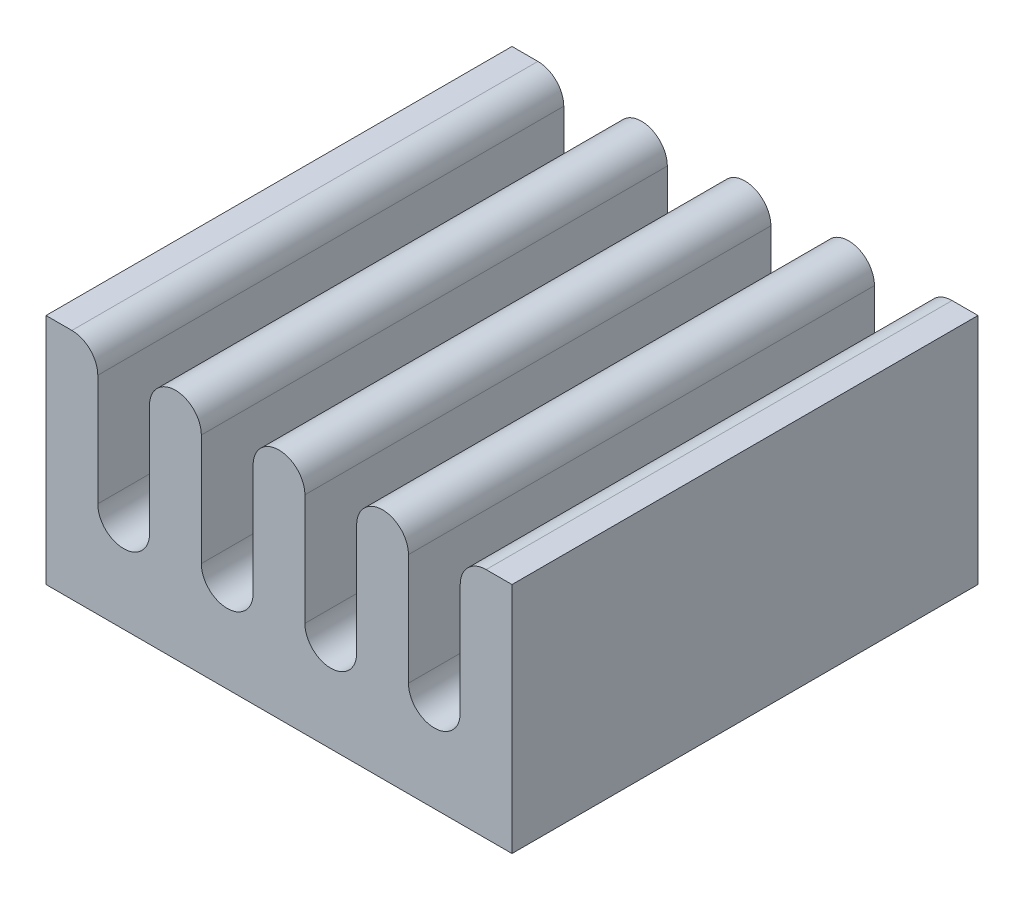
ISO-10303-21;
HEADER;
FILE_DESCRIPTION(('STEP AP214'),'2;1');
FILE_NAME('part.step','',(''),(''),'','','');
FILE_SCHEMA(('AUTOMOTIVE_DESIGN { 1 0 10303 214 1 1 1 1 }'));
ENDSEC;
DATA;
#1=APPLICATION_CONTEXT('core data for automotive mechanical design processes');
#2=APPLICATION_PROTOCOL_DEFINITION('international standard','automotive_design',2000,#1);
#3=PRODUCT_CONTEXT('',#1,'mechanical');
#4=PRODUCT('Part','Part','',(#3));
#5=PRODUCT_RELATED_PRODUCT_CATEGORY('part','',(#4));
#6=PRODUCT_DEFINITION_FORMATION('','',#4);
#7=PRODUCT_DEFINITION_CONTEXT('part definition',#1,'design');
#8=PRODUCT_DEFINITION('design','',#6,#7);
#9=PRODUCT_DEFINITION_SHAPE('','',#8);
#10=(LENGTH_UNIT() NAMED_UNIT(*) SI_UNIT(.MILLI.,.METRE.));
#11=(NAMED_UNIT(*) PLANE_ANGLE_UNIT() SI_UNIT($,.RADIAN.));
#12=(NAMED_UNIT(*) SI_UNIT($,.STERADIAN.) SOLID_ANGLE_UNIT());
#13=UNCERTAINTY_MEASURE_WITH_UNIT(LENGTH_MEASURE(1.E-05),#10,'distance_accuracy_value','');
#14=(GEOMETRIC_REPRESENTATION_CONTEXT(3) GLOBAL_UNCERTAINTY_ASSIGNED_CONTEXT((#13)) GLOBAL_UNIT_ASSIGNED_CONTEXT((#10,
#11,#12)) REPRESENTATION_CONTEXT('',''));
#15=CARTESIAN_POINT('',(0.,0.,0.));
#16=DIRECTION('',(0.,0.,1.));
#17=DIRECTION('',(1.,0.,0.));
#18=AXIS2_PLACEMENT_3D('',#15,#16,#17);
#19=CARTESIAN_POINT('',(4.,4.5,-4.5));
#20=DIRECTION('',(0.,0.,1.));
#21=DIRECTION('',(1.,0.,0.));
#22=AXIS2_PLACEMENT_3D('',#19,#20,#21);
#23=CYLINDRICAL_SURFACE('',#22,0.5);
#24=CARTESIAN_POINT('',(4.,4.5,-4.5));
#25=DIRECTION('',(0.,0.,1.));
#26=DIRECTION('',(1.,0.,0.));
#27=AXIS2_PLACEMENT_3D('',#24,#25,#26);
#28=CIRCLE('',#27,0.5);
#29=CARTESIAN_POINT('',(4.,5.,-4.5));
#30=VERTEX_POINT('',#29);
#31=CARTESIAN_POINT('',(3.5,4.5,-4.5));
#32=VERTEX_POINT('',#31);
#33=EDGE_CURVE('E198',#30,#32,#28,.T.);
#34=ORIENTED_EDGE('',*,*,#33,.T.);
#35=DIRECTION('',(0.,0.,-1.));
#36=VECTOR('',#35,1.);
#37=CARTESIAN_POINT('',(3.5,4.5,-4.5));
#38=LINE('',#37,#36);
#39=CARTESIAN_POINT('',(3.5,4.5,4.5));
#40=VERTEX_POINT('',#39);
#41=EDGE_CURVE('E200',#32,#40,#38,.F.);
#42=ORIENTED_EDGE('',*,*,#41,.T.);
#43=CARTESIAN_POINT('',(4.,4.5,4.5));
#44=DIRECTION('',(0.,0.,1.));
#45=DIRECTION('',(1.,0.,0.));
#46=AXIS2_PLACEMENT_3D('',#43,#44,#45);
#47=CIRCLE('',#46,0.5);
#48=CARTESIAN_POINT('',(4.,5.,4.5));
#49=VERTEX_POINT('',#48);
#50=EDGE_CURVE('E20',#40,#49,#47,.F.);
#51=ORIENTED_EDGE('',*,*,#50,.T.);
#52=DIRECTION('',(0.,0.,1.));
#53=VECTOR('',#52,1.);
#54=CARTESIAN_POINT('',(4.,5.,0.));
#55=LINE('',#54,#53);
#56=EDGE_CURVE('E331',#30,#49,#55,.T.);
#57=ORIENTED_EDGE('',*,*,#56,.F.);
#58=EDGE_LOOP('',(#34,#42,#51,#57));
#59=FACE_BOUND('',#58,.T.);
#60=ADVANCED_FACE('F17',(#59),#23,.T.);
#61=CARTESIAN_POINT('',(3.,2.35,-4.5));
#62=DIRECTION('',(0.,0.,-1.));
#63=DIRECTION('',(-1.,0.,0.));
#64=AXIS2_PLACEMENT_3D('',#61,#62,#63);
#65=CYLINDRICAL_SURFACE('',#64,0.5);
#66=CARTESIAN_POINT('',(3.,2.35,4.5));
#67=DIRECTION('',(0.,0.,-1.));
#68=DIRECTION('',(-1.,0.,0.));
#69=AXIS2_PLACEMENT_3D('',#66,#67,#68);
#70=CIRCLE('',#69,0.5);
#71=CARTESIAN_POINT('',(3.5,2.35,4.5));
#72=VERTEX_POINT('',#71);
#73=CARTESIAN_POINT('',(2.5,2.35,4.5));
#74=VERTEX_POINT('',#73);
#75=EDGE_CURVE('E379',#72,#74,#70,.T.);
#76=ORIENTED_EDGE('',*,*,#75,.F.);
#77=DIRECTION('',(0.,0.,-1.));
#78=VECTOR('',#77,1.);
#79=CARTESIAN_POINT('',(3.5,2.35,-4.5));
#80=LINE('',#79,#78);
#81=CARTESIAN_POINT('',(3.5,2.35,-4.5));
#82=VERTEX_POINT('',#81);
#83=EDGE_CURVE('E204',#72,#82,#80,.T.);
#84=ORIENTED_EDGE('',*,*,#83,.T.);
#85=CARTESIAN_POINT('',(3.,2.35,-4.5));
#86=DIRECTION('',(0.,0.,-1.));
#87=DIRECTION('',(-1.,0.,0.));
#88=AXIS2_PLACEMENT_3D('',#85,#86,#87);
#89=CIRCLE('',#88,0.5);
#90=CARTESIAN_POINT('',(2.5,2.35,-4.5));
#91=VERTEX_POINT('',#90);
#92=EDGE_CURVE('E381',#91,#82,#89,.F.);
#93=ORIENTED_EDGE('',*,*,#92,.F.);
#94=DIRECTION('',(0.,0.,1.));
#95=VECTOR('',#94,1.);
#96=CARTESIAN_POINT('',(2.5,2.35,-4.5));
#97=LINE('',#96,#95);
#98=EDGE_CURVE('E303',#91,#74,#97,.T.);
#99=ORIENTED_EDGE('',*,*,#98,.T.);
#100=EDGE_LOOP('',(#76,#84,#93,#99));
#101=FACE_BOUND('',#100,.T.);
#102=ADVANCED_FACE('F389',(#101),#65,.F.);
#103=CARTESIAN_POINT('',(2.,4.5,-4.5));
#104=DIRECTION('',(0.,0.,1.));
#105=DIRECTION('',(1.,0.,0.));
#106=AXIS2_PLACEMENT_3D('',#103,#104,#105);
#107=CYLINDRICAL_SURFACE('',#106,0.5);
#108=CARTESIAN_POINT('',(2.,4.5,-4.5));
#109=DIRECTION('',(0.,0.,1.));
#110=DIRECTION('',(1.,0.,0.));
#111=AXIS2_PLACEMENT_3D('',#108,#109,#110);
#112=CIRCLE('',#111,0.5);
#113=CARTESIAN_POINT('',(2.5,4.5,-4.5));
#114=VERTEX_POINT('',#113);
#115=CARTESIAN_POINT('',(1.5,4.5,-4.5));
#116=VERTEX_POINT('',#115);
#117=EDGE_CURVE('E375',#114,#116,#112,.T.);
#118=ORIENTED_EDGE('',*,*,#117,.T.);
#119=DIRECTION('',(0.,0.,-1.));
#120=VECTOR('',#119,1.);
#121=CARTESIAN_POINT('',(1.5,4.5,-4.5));
#122=LINE('',#121,#120);
#123=CARTESIAN_POINT('',(1.5,4.5,4.5));
#124=VERTEX_POINT('',#123);
#125=EDGE_CURVE('E300',#116,#124,#122,.F.);
#126=ORIENTED_EDGE('',*,*,#125,.T.);
#127=CARTESIAN_POINT('',(2.,4.5,4.5));
#128=DIRECTION('',(0.,0.,1.));
#129=DIRECTION('',(1.,0.,0.));
#130=AXIS2_PLACEMENT_3D('',#127,#128,#129);
#131=CIRCLE('',#130,0.5);
#132=CARTESIAN_POINT('',(2.5,4.5,4.5));
#133=VERTEX_POINT('',#132);
#134=EDGE_CURVE('E377',#124,#133,#131,.F.);
#135=ORIENTED_EDGE('',*,*,#134,.T.);
#136=DIRECTION('',(0.,0.,1.));
#137=VECTOR('',#136,1.);
#138=CARTESIAN_POINT('',(2.5,4.5,-4.5));
#139=LINE('',#138,#137);
#140=EDGE_CURVE('E308',#133,#114,#139,.F.);
#141=ORIENTED_EDGE('',*,*,#140,.T.);
#142=EDGE_LOOP('',(#118,#126,#135,#141));
#143=FACE_BOUND('',#142,.T.);
#144=ADVANCED_FACE('F642',(#143),#107,.T.);
#145=CARTESIAN_POINT('',(1.,2.35,-4.5));
#146=DIRECTION('',(0.,0.,-1.));
#147=DIRECTION('',(-1.,0.,0.));
#148=AXIS2_PLACEMENT_3D('',#145,#146,#147);
#149=CYLINDRICAL_SURFACE('',#148,0.5);
#150=CARTESIAN_POINT('',(1.,2.35,4.5));
#151=DIRECTION('',(0.,0.,-1.));
#152=DIRECTION('',(-1.,0.,0.));
#153=AXIS2_PLACEMENT_3D('',#150,#151,#152);
#154=CIRCLE('',#153,0.5);
#155=CARTESIAN_POINT('',(1.5,2.35,4.5));
#156=VERTEX_POINT('',#155);
#157=CARTESIAN_POINT('',(0.500000000000001,2.35,4.5));
#158=VERTEX_POINT('',#157);
#159=EDGE_CURVE('E371',#156,#158,#154,.T.);
#160=ORIENTED_EDGE('',*,*,#159,.F.);
#161=DIRECTION('',(0.,0.,-1.));
#162=VECTOR('',#161,1.);
#163=CARTESIAN_POINT('',(1.5,2.35,-4.5));
#164=LINE('',#163,#162);
#165=CARTESIAN_POINT('',(1.5,2.35,-4.5));
#166=VERTEX_POINT('',#165);
#167=EDGE_CURVE('E299',#156,#166,#164,.T.);
#168=ORIENTED_EDGE('',*,*,#167,.T.);
#169=CARTESIAN_POINT('',(1.,2.35,-4.5));
#170=DIRECTION('',(0.,0.,-1.));
#171=DIRECTION('',(-1.,0.,0.));
#172=AXIS2_PLACEMENT_3D('',#169,#170,#171);
#173=CIRCLE('',#172,0.5);
#174=CARTESIAN_POINT('',(0.5,2.35,-4.5));
#175=VERTEX_POINT('',#174);
#176=EDGE_CURVE('E373',#175,#166,#173,.F.);
#177=ORIENTED_EDGE('',*,*,#176,.F.);
#178=DIRECTION('',(0.,0.,1.));
#179=VECTOR('',#178,1.);
#180=CARTESIAN_POINT('',(0.5,2.35,-4.5));
#181=LINE('',#180,#179);
#182=EDGE_CURVE('E291',#175,#158,#181,.T.);
#183=ORIENTED_EDGE('',*,*,#182,.T.);
#184=EDGE_LOOP('',(#160,#168,#177,#183));
#185=FACE_BOUND('',#184,.T.);
#186=ADVANCED_FACE('F634',(#185),#149,.F.);
#187=CARTESIAN_POINT('',(0.,4.5,-4.5));
#188=DIRECTION('',(0.,0.,1.));
#189=DIRECTION('',(1.,0.,0.));
#190=AXIS2_PLACEMENT_3D('',#187,#188,#189);
#191=CYLINDRICAL_SURFACE('',#190,0.5);
#192=CARTESIAN_POINT('',(0.,4.5,-4.5));
#193=DIRECTION('',(0.,0.,1.));
#194=DIRECTION('',(1.,0.,0.));
#195=AXIS2_PLACEMENT_3D('',#192,#193,#194);
#196=CIRCLE('',#195,0.5);
#197=CARTESIAN_POINT('',(0.5,4.5,-4.5));
#198=VERTEX_POINT('',#197);
#199=CARTESIAN_POINT('',(-0.5,4.5,-4.5));
#200=VERTEX_POINT('',#199);
#201=EDGE_CURVE('E367',#198,#200,#196,.T.);
#202=ORIENTED_EDGE('',*,*,#201,.T.);
#203=DIRECTION('',(0.,0.,-1.));
#204=VECTOR('',#203,1.);
#205=CARTESIAN_POINT('',(-0.5,4.5,-4.5));
#206=LINE('',#205,#204);
#207=CARTESIAN_POINT('',(-0.499999999999999,4.5,4.5));
#208=VERTEX_POINT('',#207);
#209=EDGE_CURVE('E288',#200,#208,#206,.F.);
#210=ORIENTED_EDGE('',*,*,#209,.T.);
#211=CARTESIAN_POINT('',(0.,4.5,4.5));
#212=DIRECTION('',(0.,0.,1.));
#213=DIRECTION('',(1.,0.,0.));
#214=AXIS2_PLACEMENT_3D('',#211,#212,#213);
#215=CIRCLE('',#214,0.5);
#216=CARTESIAN_POINT('',(0.500000000000001,4.5,4.5));
#217=VERTEX_POINT('',#216);
#218=EDGE_CURVE('E369',#208,#217,#215,.F.);
#219=ORIENTED_EDGE('',*,*,#218,.T.);
#220=DIRECTION('',(0.,0.,1.));
#221=VECTOR('',#220,1.);
#222=CARTESIAN_POINT('',(0.5,4.5,-4.5));
#223=LINE('',#222,#221);
#224=EDGE_CURVE('E296',#217,#198,#223,.F.);
#225=ORIENTED_EDGE('',*,*,#224,.T.);
#226=EDGE_LOOP('',(#202,#210,#219,#225));
#227=FACE_BOUND('',#226,.T.);
#228=ADVANCED_FACE('F626',(#227),#191,.T.);
#229=CARTESIAN_POINT('',(-1.,2.35,-4.5));
#230=DIRECTION('',(0.,0.,-1.));
#231=DIRECTION('',(-1.,0.,0.));
#232=AXIS2_PLACEMENT_3D('',#229,#230,#231);
#233=CYLINDRICAL_SURFACE('',#232,0.5);
#234=CARTESIAN_POINT('',(-0.999999999999999,2.35,4.5));
#235=DIRECTION('',(0.,0.,-1.));
#236=DIRECTION('',(-1.,0.,0.));
#237=AXIS2_PLACEMENT_3D('',#234,#235,#236);
#238=CIRCLE('',#237,0.5);
#239=CARTESIAN_POINT('',(-0.499999999999999,2.35,4.5));
#240=VERTEX_POINT('',#239);
#241=CARTESIAN_POINT('',(-1.5,2.35,4.5));
#242=VERTEX_POINT('',#241);
#243=EDGE_CURVE('E363',#240,#242,#238,.T.);
#244=ORIENTED_EDGE('',*,*,#243,.F.);
#245=DIRECTION('',(0.,0.,-1.));
#246=VECTOR('',#245,1.);
#247=CARTESIAN_POINT('',(-0.5,2.35,-4.5));
#248=LINE('',#247,#246);
#249=CARTESIAN_POINT('',(-0.5,2.35,-4.5));
#250=VERTEX_POINT('',#249);
#251=EDGE_CURVE('E287',#240,#250,#248,.T.);
#252=ORIENTED_EDGE('',*,*,#251,.T.);
#253=CARTESIAN_POINT('',(-1.,2.35,-4.5));
#254=DIRECTION('',(0.,0.,-1.));
#255=DIRECTION('',(-1.,0.,0.));
#256=AXIS2_PLACEMENT_3D('',#253,#254,#255);
#257=CIRCLE('',#256,0.5);
#258=CARTESIAN_POINT('',(-1.5,2.35,-4.5));
#259=VERTEX_POINT('',#258);
#260=EDGE_CURVE('E365',#259,#250,#257,.F.);
#261=ORIENTED_EDGE('',*,*,#260,.F.);
#262=DIRECTION('',(0.,0.,1.));
#263=VECTOR('',#262,1.);
#264=CARTESIAN_POINT('',(-1.5,2.35,-4.5));
#265=LINE('',#264,#263);
#266=EDGE_CURVE('E279',#259,#242,#265,.T.);
#267=ORIENTED_EDGE('',*,*,#266,.T.);
#268=EDGE_LOOP('',(#244,#252,#261,#267));
#269=FACE_BOUND('',#268,.T.);
#270=ADVANCED_FACE('F618',(#269),#233,.F.);
#271=CARTESIAN_POINT('',(-2.,4.5,-4.5));
#272=DIRECTION('',(0.,0.,1.));
#273=DIRECTION('',(1.,0.,0.));
#274=AXIS2_PLACEMENT_3D('',#271,#272,#273);
#275=CYLINDRICAL_SURFACE('',#274,0.5);
#276=CARTESIAN_POINT('',(-2.,4.5,-4.5));
#277=DIRECTION('',(0.,0.,1.));
#278=DIRECTION('',(1.,0.,0.));
#279=AXIS2_PLACEMENT_3D('',#276,#277,#278);
#280=CIRCLE('',#279,0.5);
#281=CARTESIAN_POINT('',(-1.5,4.5,-4.5));
#282=VERTEX_POINT('',#281);
#283=CARTESIAN_POINT('',(-2.5,4.5,-4.5));
#284=VERTEX_POINT('',#283);
#285=EDGE_CURVE('E359',#282,#284,#280,.T.);
#286=ORIENTED_EDGE('',*,*,#285,.T.);
#287=DIRECTION('',(0.,0.,-1.));
#288=VECTOR('',#287,1.);
#289=CARTESIAN_POINT('',(-2.5,4.5,-4.5));
#290=LINE('',#289,#288);
#291=CARTESIAN_POINT('',(-2.5,4.5,4.5));
#292=VERTEX_POINT('',#291);
#293=EDGE_CURVE('E276',#284,#292,#290,.F.);
#294=ORIENTED_EDGE('',*,*,#293,.T.);
#295=CARTESIAN_POINT('',(-2.,4.5,4.5));
#296=DIRECTION('',(0.,0.,1.));
#297=DIRECTION('',(1.,0.,0.));
#298=AXIS2_PLACEMENT_3D('',#295,#296,#297);
#299=CIRCLE('',#298,0.5);
#300=CARTESIAN_POINT('',(-1.5,4.5,4.5));
#301=VERTEX_POINT('',#300);
#302=EDGE_CURVE('E361',#292,#301,#299,.F.);
#303=ORIENTED_EDGE('',*,*,#302,.T.);
#304=DIRECTION('',(0.,0.,1.));
#305=VECTOR('',#304,1.);
#306=CARTESIAN_POINT('',(-1.5,4.5,-4.5));
#307=LINE('',#306,#305);
#308=EDGE_CURVE('E284',#301,#282,#307,.F.);
#309=ORIENTED_EDGE('',*,*,#308,.T.);
#310=EDGE_LOOP('',(#286,#294,#303,#309));
#311=FACE_BOUND('',#310,.T.);
#312=ADVANCED_FACE('F610',(#311),#275,.T.);
#313=CARTESIAN_POINT('',(-4.,4.5,-4.5));
#314=DIRECTION('',(0.,0.,-1.));
#315=DIRECTION('',(-1.,0.,0.));
#316=AXIS2_PLACEMENT_3D('',#313,#314,#315);
#317=CYLINDRICAL_SURFACE('',#316,0.5);
#318=CARTESIAN_POINT('',(-4.,4.5,4.5));
#319=DIRECTION('',(0.,0.,-1.));
#320=DIRECTION('',(-1.,0.,0.));
#321=AXIS2_PLACEMENT_3D('',#318,#319,#320);
#322=CIRCLE('',#321,0.5);
#323=CARTESIAN_POINT('',(-4.,5.,4.5));
#324=VERTEX_POINT('',#323);
#325=CARTESIAN_POINT('',(-3.5,4.5,4.5));
#326=VERTEX_POINT('',#325);
#327=EDGE_CURVE('E355',#324,#326,#322,.T.);
#328=ORIENTED_EDGE('',*,*,#327,.T.);
#329=DIRECTION('',(0.,0.,1.));
#330=VECTOR('',#329,1.);
#331=CARTESIAN_POINT('',(-3.5,4.5,-4.5));
#332=LINE('',#331,#330);
#333=CARTESIAN_POINT('',(-3.5,4.5,-4.5));
#334=VERTEX_POINT('',#333);
#335=EDGE_CURVE('E272',#326,#334,#332,.F.);
#336=ORIENTED_EDGE('',*,*,#335,.T.);
#337=CARTESIAN_POINT('',(-4.,4.5,-4.5));
#338=DIRECTION('',(0.,0.,-1.));
#339=DIRECTION('',(-1.,0.,0.));
#340=AXIS2_PLACEMENT_3D('',#337,#338,#339);
#341=CIRCLE('',#340,0.5);
#342=CARTESIAN_POINT('',(-4.,5.,-4.5));
#343=VERTEX_POINT('',#342);
#344=EDGE_CURVE('E357',#334,#343,#341,.F.);
#345=ORIENTED_EDGE('',*,*,#344,.T.);
#346=DIRECTION('',(0.,0.,1.));
#347=VECTOR('',#346,1.);
#348=CARTESIAN_POINT('',(-4.,5.,0.));
#349=LINE('',#348,#347);
#350=EDGE_CURVE('E312',#324,#343,#349,.F.);
#351=ORIENTED_EDGE('',*,*,#350,.F.);
#352=EDGE_LOOP('',(#328,#336,#345,#351));
#353=FACE_BOUND('',#352,.T.);
#354=ADVANCED_FACE('F602',(#353),#317,.T.);
#355=CARTESIAN_POINT('',(-3.,2.35,-4.5));
#356=DIRECTION('',(0.,0.,-1.));
#357=DIRECTION('',(-1.,0.,0.));
#358=AXIS2_PLACEMENT_3D('',#355,#356,#357);
#359=CYLINDRICAL_SURFACE('',#358,0.5);
#360=CARTESIAN_POINT('',(-3.,2.35,4.5));
#361=DIRECTION('',(0.,0.,-1.));
#362=DIRECTION('',(-1.,0.,0.));
#363=AXIS2_PLACEMENT_3D('',#360,#361,#362);
#364=CIRCLE('',#363,0.5);
#365=CARTESIAN_POINT('',(-2.5,2.35,4.5));
#366=VERTEX_POINT('',#365);
#367=CARTESIAN_POINT('',(-3.5,2.35,4.5));
#368=VERTEX_POINT('',#367);
#369=EDGE_CURVE('E345',#366,#368,#364,.T.);
#370=ORIENTED_EDGE('',*,*,#369,.F.);
#371=DIRECTION('',(0.,0.,-1.));
#372=VECTOR('',#371,1.);
#373=CARTESIAN_POINT('',(-2.5,2.35,-4.5));
#374=LINE('',#373,#372);
#375=CARTESIAN_POINT('',(-2.5,2.35,-4.5));
#376=VERTEX_POINT('',#375);
#377=EDGE_CURVE('E275',#366,#376,#374,.T.);
#378=ORIENTED_EDGE('',*,*,#377,.T.);
#379=CARTESIAN_POINT('',(-3.,2.35,-4.5));
#380=DIRECTION('',(0.,0.,-1.));
#381=DIRECTION('',(-1.,0.,0.));
#382=AXIS2_PLACEMENT_3D('',#379,#380,#381);
#383=CIRCLE('',#382,0.5);
#384=CARTESIAN_POINT('',(-3.5,2.35,-4.5));
#385=VERTEX_POINT('',#384);
#386=EDGE_CURVE('E353',#385,#376,#383,.F.);
#387=ORIENTED_EDGE('',*,*,#386,.F.);
#388=DIRECTION('',(0.,0.,1.));
#389=VECTOR('',#388,1.);
#390=CARTESIAN_POINT('',(-3.5,2.35,-4.5));
#391=LINE('',#390,#389);
#392=EDGE_CURVE('E269',#385,#368,#391,.T.);
#393=ORIENTED_EDGE('',*,*,#392,.T.);
#394=EDGE_LOOP('',(#370,#378,#387,#393));
#395=FACE_BOUND('',#394,.T.);
#396=ADVANCED_FACE('F456',(#395),#359,.F.);
#397=CARTESIAN_POINT('',(0.,0.,0.));
#398=DIRECTION('',(0.,1.,0.));
#399=DIRECTION('',(0.,0.,1.));
#400=AXIS2_PLACEMENT_3D('',#397,#398,#399);
#401=PLANE('',#400);
#402=DIRECTION('',(-1.,0.,0.));
#403=VECTOR('',#402,1.);
#404=CARTESIAN_POINT('',(-3.5,0.,-4.));
#405=LINE('',#404,#403);
#406=CARTESIAN_POINT('',(2.5,0.,-4.));
#407=VERTEX_POINT('',#406);
#408=CARTESIAN_POINT('',(-3.5,0.,-4.));
#409=VERTEX_POINT('',#408);
#410=EDGE_CURVE('E257',#407,#409,#405,.T.);
#411=ORIENTED_EDGE('',*,*,#410,.F.);
#412=DIRECTION('',(0.,0.,-1.));
#413=VECTOR('',#412,1.);
#414=CARTESIAN_POINT('',(2.5,0.,2.));
#415=LINE('',#414,#413);
#416=CARTESIAN_POINT('',(2.5,0.,2.));
#417=VERTEX_POINT('',#416);
#418=EDGE_CURVE('E263',#417,#407,#415,.T.);
#419=ORIENTED_EDGE('',*,*,#418,.F.);
#420=DIRECTION('',(1.,0.,0.));
#421=VECTOR('',#420,1.);
#422=CARTESIAN_POINT('',(-3.5,0.,2.));
#423=LINE('',#422,#421);
#424=CARTESIAN_POINT('',(-3.5,0.,2.));
#425=VERTEX_POINT('',#424);
#426=EDGE_CURVE('E266',#425,#417,#423,.T.);
#427=ORIENTED_EDGE('',*,*,#426,.F.);
#428=DIRECTION('',(0.,0.,1.));
#429=VECTOR('',#428,1.);
#430=CARTESIAN_POINT('',(-3.5,0.,2.));
#431=LINE('',#430,#429);
#432=EDGE_CURVE('E251',#409,#425,#431,.T.);
#433=ORIENTED_EDGE('',*,*,#432,.F.);
#434=EDGE_LOOP('',(#411,#419,#427,#433));
#435=FACE_BOUND('',#434,.T.);
#436=ADVANCED_FACE('F448',(#435),#401,.F.);
#437=CARTESIAN_POINT('',(0.,5.,0.));
#438=DIRECTION('',(0.,1.,0.));
#439=DIRECTION('',(0.,0.,1.));
#440=AXIS2_PLACEMENT_3D('',#437,#438,#439);
#441=PLANE('',#440);
#442=DIRECTION('',(1.,0.,0.));
#443=VECTOR('',#442,1.);
#444=CARTESIAN_POINT('',(0.,5.,4.5));
#445=LINE('',#444,#443);
#446=CARTESIAN_POINT('',(4.5,5.,4.5));
#447=VERTEX_POINT('',#446);
#448=EDGE_CURVE('E194',#49,#447,#445,.T.);
#449=ORIENTED_EDGE('',*,*,#448,.T.);
#450=DIRECTION('',(0.,0.,1.));
#451=VECTOR('',#450,1.);
#452=CARTESIAN_POINT('',(4.5,5.,-4.5));
#453=LINE('',#452,#451);
#454=CARTESIAN_POINT('',(4.5,5.,-4.5));
#455=VERTEX_POINT('',#454);
#456=EDGE_CURVE('E242',#447,#455,#453,.F.);
#457=ORIENTED_EDGE('',*,*,#456,.T.);
#458=DIRECTION('',(1.,0.,0.));
#459=VECTOR('',#458,1.);
#460=CARTESIAN_POINT('',(0.,5.,-4.5));
#461=LINE('',#460,#459);
#462=EDGE_CURVE('E333',#455,#30,#461,.F.);
#463=ORIENTED_EDGE('',*,*,#462,.T.);
#464=ORIENTED_EDGE('',*,*,#56,.T.);
#465=EDGE_LOOP('',(#449,#457,#463,#464));
#466=FACE_BOUND('',#465,.T.);
#467=ADVANCED_FACE('F446',(#466),#441,.T.);
#468=CARTESIAN_POINT('',(0.,5.,0.));
#469=DIRECTION('',(0.,1.,0.));
#470=DIRECTION('',(0.,0.,1.));
#471=AXIS2_PLACEMENT_3D('',#468,#469,#470);
#472=PLANE('',#471);
#473=DIRECTION('',(1.,0.,0.));
#474=VECTOR('',#473,1.);
#475=CARTESIAN_POINT('',(0.,5.,-4.5));
#476=LINE('',#475,#474);
#477=CARTESIAN_POINT('',(-4.5,5.,-4.5));
#478=VERTEX_POINT('',#477);
#479=EDGE_CURVE('E205',#343,#478,#476,.F.);
#480=ORIENTED_EDGE('',*,*,#479,.T.);
#481=DIRECTION('',(0.,0.,-1.));
#482=VECTOR('',#481,1.);
#483=CARTESIAN_POINT('',(-4.5,5.,-4.5));
#484=LINE('',#483,#482);
#485=CARTESIAN_POINT('',(-4.5,5.,4.5));
#486=VERTEX_POINT('',#485);
#487=EDGE_CURVE('E213',#478,#486,#484,.F.);
#488=ORIENTED_EDGE('',*,*,#487,.T.);
#489=DIRECTION('',(-1.,0.,0.));
#490=VECTOR('',#489,1.);
#491=CARTESIAN_POINT('',(-4.5,5.,4.5));
#492=LINE('',#491,#490);
#493=EDGE_CURVE('E239',#486,#324,#492,.F.);
#494=ORIENTED_EDGE('',*,*,#493,.T.);
#495=ORIENTED_EDGE('',*,*,#350,.T.);
#496=EDGE_LOOP('',(#480,#488,#494,#495));
#497=FACE_BOUND('',#496,.T.);
#498=ADVANCED_FACE('F438',(#497),#472,.T.);
#499=CARTESIAN_POINT('',(3.5,-9.05538513813741,-4.5));
#500=DIRECTION('',(1.,0.,0.));
#501=DIRECTION('',(0.,0.,-1.));
#502=AXIS2_PLACEMENT_3D('',#499,#500,#501);
#503=PLANE('',#502);
#504=ORIENTED_EDGE('',*,*,#83,.F.);
#505=DIRECTION('',(0.,1.,0.));
#506=VECTOR('',#505,1.);
#507=CARTESIAN_POINT('',(3.5,5.,4.5));
#508=LINE('',#507,#506);
#509=EDGE_CURVE('E193',#72,#40,#508,.T.);
#510=ORIENTED_EDGE('',*,*,#509,.T.);
#511=ORIENTED_EDGE('',*,*,#41,.F.);
#512=DIRECTION('',(0.,1.,0.));
#513=VECTOR('',#512,1.);
#514=CARTESIAN_POINT('',(3.5,5.,-4.5));
#515=LINE('',#514,#513);
#516=EDGE_CURVE('E219',#32,#82,#515,.F.);
#517=ORIENTED_EDGE('',*,*,#516,.T.);
#518=EDGE_LOOP('',(#504,#510,#511,#517));
#519=FACE_BOUND('',#518,.T.);
#520=ADVANCED_FACE('F208',(#519),#503,.F.);
#521=CARTESIAN_POINT('',(2.5,-9.05538513813741,-4.5));
#522=DIRECTION('',(-1.,0.,0.));
#523=DIRECTION('',(0.,0.,1.));
#524=AXIS2_PLACEMENT_3D('',#521,#522,#523);
#525=PLANE('',#524);
#526=ORIENTED_EDGE('',*,*,#98,.F.);
#527=DIRECTION('',(0.,1.,0.));
#528=VECTOR('',#527,1.);
#529=CARTESIAN_POINT('',(2.5,5.,-4.5));
#530=LINE('',#529,#528);
#531=EDGE_CURVE('E386',#91,#114,#530,.T.);
#532=ORIENTED_EDGE('',*,*,#531,.T.);
#533=ORIENTED_EDGE('',*,*,#140,.F.);
#534=DIRECTION('',(0.,1.,0.));
#535=VECTOR('',#534,1.);
#536=CARTESIAN_POINT('',(2.5,5.,4.5));
#537=LINE('',#536,#535);
#538=EDGE_CURVE('E211',#133,#74,#537,.F.);
#539=ORIENTED_EDGE('',*,*,#538,.T.);
#540=EDGE_LOOP('',(#526,#532,#533,#539));
#541=FACE_BOUND('',#540,.T.);
#542=ADVANCED_FACE('F511',(#541),#525,.F.);
#543=CARTESIAN_POINT('',(1.5,-9.05538513813741,-4.5));
#544=DIRECTION('',(1.,0.,0.));
#545=DIRECTION('',(0.,0.,-1.));
#546=AXIS2_PLACEMENT_3D('',#543,#544,#545);
#547=PLANE('',#546);
#548=ORIENTED_EDGE('',*,*,#167,.F.);
#549=DIRECTION('',(0.,1.,0.));
#550=VECTOR('',#549,1.);
#551=CARTESIAN_POINT('',(1.5,5.,4.5));
#552=LINE('',#551,#550);
#553=EDGE_CURVE('E216',#156,#124,#552,.T.);
#554=ORIENTED_EDGE('',*,*,#553,.T.);
#555=ORIENTED_EDGE('',*,*,#125,.F.);
#556=DIRECTION('',(0.,1.,0.));
#557=VECTOR('',#556,1.);
#558=CARTESIAN_POINT('',(1.5,5.,-4.5));
#559=LINE('',#558,#557);
#560=EDGE_CURVE('E390',#116,#166,#559,.F.);
#561=ORIENTED_EDGE('',*,*,#560,.T.);
#562=EDGE_LOOP('',(#548,#554,#555,#561));
#563=FACE_BOUND('',#562,.T.);
#564=ADVANCED_FACE('F507',(#563),#547,.F.);
#565=CARTESIAN_POINT('',(0.5,-9.05538513813741,-4.5));
#566=DIRECTION('',(-1.,0.,0.));
#567=DIRECTION('',(0.,0.,1.));
#568=AXIS2_PLACEMENT_3D('',#565,#566,#567);
#569=PLANE('',#568);
#570=ORIENTED_EDGE('',*,*,#182,.F.);
#571=DIRECTION('',(0.,1.,0.));
#572=VECTOR('',#571,1.);
#573=CARTESIAN_POINT('',(0.5,5.,-4.5));
#574=LINE('',#573,#572);
#575=EDGE_CURVE('E394',#175,#198,#574,.T.);
#576=ORIENTED_EDGE('',*,*,#575,.T.);
#577=ORIENTED_EDGE('',*,*,#224,.F.);
#578=DIRECTION('',(0.,1.,0.));
#579=VECTOR('',#578,1.);
#580=CARTESIAN_POINT('',(0.500000000000001,5.,4.5));
#581=LINE('',#580,#579);
#582=EDGE_CURVE('E224',#217,#158,#581,.F.);
#583=ORIENTED_EDGE('',*,*,#582,.T.);
#584=EDGE_LOOP('',(#570,#576,#577,#583));
#585=FACE_BOUND('',#584,.T.);
#586=ADVANCED_FACE('F503',(#585),#569,.F.);
#587=CARTESIAN_POINT('',(-0.5,-9.05538513813741,-4.5));
#588=DIRECTION('',(1.,0.,0.));
#589=DIRECTION('',(0.,0.,-1.));
#590=AXIS2_PLACEMENT_3D('',#587,#588,#589);
#591=PLANE('',#590);
#592=ORIENTED_EDGE('',*,*,#251,.F.);
#593=DIRECTION('',(0.,1.,0.));
#594=VECTOR('',#593,1.);
#595=CARTESIAN_POINT('',(-0.5,5.,4.5));
#596=LINE('',#595,#594);
#597=EDGE_CURVE('E227',#240,#208,#596,.T.);
#598=ORIENTED_EDGE('',*,*,#597,.T.);
#599=ORIENTED_EDGE('',*,*,#209,.F.);
#600=DIRECTION('',(0.,1.,0.));
#601=VECTOR('',#600,1.);
#602=CARTESIAN_POINT('',(-0.5,5.,-4.5));
#603=LINE('',#602,#601);
#604=EDGE_CURVE('E399',#200,#250,#603,.F.);
#605=ORIENTED_EDGE('',*,*,#604,.T.);
#606=EDGE_LOOP('',(#592,#598,#599,#605));
#607=FACE_BOUND('',#606,.T.);
#608=ADVANCED_FACE('F499',(#607),#591,.F.);
#609=CARTESIAN_POINT('',(-1.5,-9.05538513813741,-4.5));
#610=DIRECTION('',(-1.,0.,0.));
#611=DIRECTION('',(0.,0.,1.));
#612=AXIS2_PLACEMENT_3D('',#609,#610,#611);
#613=PLANE('',#612);
#614=ORIENTED_EDGE('',*,*,#266,.F.);
#615=DIRECTION('',(0.,1.,0.));
#616=VECTOR('',#615,1.);
#617=CARTESIAN_POINT('',(-1.5,5.,-4.5));
#618=LINE('',#617,#616);
#619=EDGE_CURVE('E402',#259,#282,#618,.T.);
#620=ORIENTED_EDGE('',*,*,#619,.T.);
#621=ORIENTED_EDGE('',*,*,#308,.F.);
#622=DIRECTION('',(0.,1.,0.));
#623=VECTOR('',#622,1.);
#624=CARTESIAN_POINT('',(-1.5,5.,4.5));
#625=LINE('',#624,#623);
#626=EDGE_CURVE('E230',#301,#242,#625,.F.);
#627=ORIENTED_EDGE('',*,*,#626,.T.);
#628=EDGE_LOOP('',(#614,#620,#621,#627));
#629=FACE_BOUND('',#628,.T.);
#630=ADVANCED_FACE('F495',(#629),#613,.F.);
#631=CARTESIAN_POINT('',(-2.5,-9.05538513813741,-4.5));
#632=DIRECTION('',(1.,0.,0.));
#633=DIRECTION('',(0.,0.,-1.));
#634=AXIS2_PLACEMENT_3D('',#631,#632,#633);
#635=PLANE('',#634);
#636=ORIENTED_EDGE('',*,*,#377,.F.);
#637=DIRECTION('',(0.,1.,0.));
#638=VECTOR('',#637,1.);
#639=CARTESIAN_POINT('',(-2.5,5.,4.5));
#640=LINE('',#639,#638);
#641=EDGE_CURVE('E233',#366,#292,#640,.T.);
#642=ORIENTED_EDGE('',*,*,#641,.T.);
#643=ORIENTED_EDGE('',*,*,#293,.F.);
#644=DIRECTION('',(0.,1.,0.));
#645=VECTOR('',#644,1.);
#646=CARTESIAN_POINT('',(-2.5,5.,-4.5));
#647=LINE('',#646,#645);
#648=EDGE_CURVE('E405',#284,#376,#647,.F.);
#649=ORIENTED_EDGE('',*,*,#648,.T.);
#650=EDGE_LOOP('',(#636,#642,#643,#649));
#651=FACE_BOUND('',#650,.T.);
#652=ADVANCED_FACE('F491',(#651),#635,.F.);
#653=CARTESIAN_POINT('',(-3.5,-9.05538513813741,-4.5));
#654=DIRECTION('',(-1.,0.,0.));
#655=DIRECTION('',(0.,0.,1.));
#656=AXIS2_PLACEMENT_3D('',#653,#654,#655);
#657=PLANE('',#656);
#658=ORIENTED_EDGE('',*,*,#392,.F.);
#659=DIRECTION('',(0.,1.,0.));
#660=VECTOR('',#659,1.);
#661=CARTESIAN_POINT('',(-3.5,5.,-4.5));
#662=LINE('',#661,#660);
#663=EDGE_CURVE('E328',#385,#334,#662,.T.);
#664=ORIENTED_EDGE('',*,*,#663,.T.);
#665=ORIENTED_EDGE('',*,*,#335,.F.);
#666=DIRECTION('',(0.,1.,0.));
#667=VECTOR('',#666,1.);
#668=CARTESIAN_POINT('',(-3.5,5.,4.5));
#669=LINE('',#668,#667);
#670=EDGE_CURVE('E236',#326,#368,#669,.F.);
#671=ORIENTED_EDGE('',*,*,#670,.T.);
#672=EDGE_LOOP('',(#658,#664,#665,#671));
#673=FACE_BOUND('',#672,.T.);
#674=ADVANCED_FACE('F487',(#673),#657,.F.);
#675=CARTESIAN_POINT('',(-3.5,0.5,2.));
#676=DIRECTION('',(0.,0.,1.));
#677=DIRECTION('',(1.,0.,0.));
#678=AXIS2_PLACEMENT_3D('',#675,#676,#677);
#679=PLANE('',#678);
#680=DIRECTION('',(1.,0.,0.));
#681=VECTOR('',#680,1.);
#682=CARTESIAN_POINT('',(0.,0.5,2.));
#683=LINE('',#682,#681);
#684=CARTESIAN_POINT('',(-3.5,0.5,2.));
#685=VERTEX_POINT('',#684);
#686=CARTESIAN_POINT('',(2.5,0.5,2.));
#687=VERTEX_POINT('',#686);
#688=EDGE_CURVE('E327',#685,#687,#683,.T.);
#689=ORIENTED_EDGE('',*,*,#688,.F.);
#690=DIRECTION('',(0.,1.,0.));
#691=VECTOR('',#690,1.);
#692=CARTESIAN_POINT('',(-3.5,0.5,2.));
#693=LINE('',#692,#691);
#694=EDGE_CURVE('E248',#425,#685,#693,.T.);
#695=ORIENTED_EDGE('',*,*,#694,.F.);
#696=ORIENTED_EDGE('',*,*,#426,.T.);
#697=DIRECTION('',(0.,1.,0.));
#698=VECTOR('',#697,1.);
#699=CARTESIAN_POINT('',(2.5,0.5,2.));
#700=LINE('',#699,#698);
#701=EDGE_CURVE('E260',#687,#417,#700,.F.);
#702=ORIENTED_EDGE('',*,*,#701,.F.);
#703=EDGE_LOOP('',(#689,#695,#696,#702));
#704=FACE_BOUND('',#703,.T.);
#705=ADVANCED_FACE('F483',(#704),#679,.T.);
#706=CARTESIAN_POINT('',(2.5,0.5,2.));
#707=DIRECTION('',(1.,0.,0.));
#708=DIRECTION('',(0.,0.,-1.));
#709=AXIS2_PLACEMENT_3D('',#706,#707,#708);
#710=PLANE('',#709);
#711=DIRECTION('',(0.,0.,-1.));
#712=VECTOR('',#711,1.);
#713=CARTESIAN_POINT('',(2.5,0.5,0.));
#714=LINE('',#713,#712);
#715=CARTESIAN_POINT('',(2.5,0.5,-4.));
#716=VERTEX_POINT('',#715);
#717=EDGE_CURVE('E412',#687,#716,#714,.T.);
#718=ORIENTED_EDGE('',*,*,#717,.F.);
#719=ORIENTED_EDGE('',*,*,#701,.T.);
#720=ORIENTED_EDGE('',*,*,#418,.T.);
#721=DIRECTION('',(0.,1.,0.));
#722=VECTOR('',#721,1.);
#723=CARTESIAN_POINT('',(2.5,0.5,-4.));
#724=LINE('',#723,#722);
#725=EDGE_CURVE('E254',#716,#407,#724,.F.);
#726=ORIENTED_EDGE('',*,*,#725,.F.);
#727=EDGE_LOOP('',(#718,#719,#720,#726));
#728=FACE_BOUND('',#727,.T.);
#729=ADVANCED_FACE('F479',(#728),#710,.T.);
#730=CARTESIAN_POINT('',(-3.5,0.5,-4.));
#731=DIRECTION('',(0.,0.,-1.));
#732=DIRECTION('',(-1.,0.,0.));
#733=AXIS2_PLACEMENT_3D('',#730,#731,#732);
#734=PLANE('',#733);
#735=DIRECTION('',(1.,0.,0.));
#736=VECTOR('',#735,1.);
#737=CARTESIAN_POINT('',(0.,0.5,-4.));
#738=LINE('',#737,#736);
#739=CARTESIAN_POINT('',(-3.5,0.5,-4.));
#740=VERTEX_POINT('',#739);
#741=EDGE_CURVE('E415',#716,#740,#738,.F.);
#742=ORIENTED_EDGE('',*,*,#741,.F.);
#743=ORIENTED_EDGE('',*,*,#725,.T.);
#744=ORIENTED_EDGE('',*,*,#410,.T.);
#745=DIRECTION('',(0.,1.,0.));
#746=VECTOR('',#745,1.);
#747=CARTESIAN_POINT('',(-3.5,0.5,-4.));
#748=LINE('',#747,#746);
#749=EDGE_CURVE('E245',#740,#409,#748,.F.);
#750=ORIENTED_EDGE('',*,*,#749,.F.);
#751=EDGE_LOOP('',(#742,#743,#744,#750));
#752=FACE_BOUND('',#751,.T.);
#753=ADVANCED_FACE('F475',(#752),#734,.T.);
#754=CARTESIAN_POINT('',(-3.5,0.5,2.));
#755=DIRECTION('',(-1.,0.,0.));
#756=DIRECTION('',(0.,0.,1.));
#757=AXIS2_PLACEMENT_3D('',#754,#755,#756);
#758=PLANE('',#757);
#759=DIRECTION('',(0.,0.,-1.));
#760=VECTOR('',#759,1.);
#761=CARTESIAN_POINT('',(-3.5,0.5,0.));
#762=LINE('',#761,#760);
#763=EDGE_CURVE('E418',#740,#685,#762,.F.);
#764=ORIENTED_EDGE('',*,*,#763,.F.);
#765=ORIENTED_EDGE('',*,*,#749,.T.);
#766=ORIENTED_EDGE('',*,*,#432,.T.);
#767=ORIENTED_EDGE('',*,*,#694,.T.);
#768=EDGE_LOOP('',(#764,#765,#766,#767));
#769=FACE_BOUND('',#768,.T.);
#770=ADVANCED_FACE('F472',(#769),#758,.T.);
#771=CARTESIAN_POINT('',(4.5,5.,-4.5));
#772=DIRECTION('',(-1.,0.,0.));
#773=DIRECTION('',(0.,0.,1.));
#774=AXIS2_PLACEMENT_3D('',#771,#772,#773);
#775=PLANE('',#774);
#776=DIRECTION('',(0.,1.,0.));
#777=VECTOR('',#776,1.);
#778=CARTESIAN_POINT('',(4.5,5.,-4.5));
#779=LINE('',#778,#777);
#780=CARTESIAN_POINT('',(4.5,0.5,-4.5));
#781=VERTEX_POINT('',#780);
#782=EDGE_CURVE('E320',#781,#455,#779,.T.);
#783=ORIENTED_EDGE('',*,*,#782,.T.);
#784=ORIENTED_EDGE('',*,*,#456,.F.);
#785=DIRECTION('',(0.,1.,0.));
#786=VECTOR('',#785,1.);
#787=CARTESIAN_POINT('',(4.5,5.,4.5));
#788=LINE('',#787,#786);
#789=CARTESIAN_POINT('',(4.5,0.5,4.5));
#790=VERTEX_POINT('',#789);
#791=EDGE_CURVE('E210',#447,#790,#788,.F.);
#792=ORIENTED_EDGE('',*,*,#791,.T.);
#793=DIRECTION('',(0.,0.,-1.));
#794=VECTOR('',#793,1.);
#795=CARTESIAN_POINT('',(4.5,0.5,0.));
#796=LINE('',#795,#794);
#797=EDGE_CURVE('E421',#781,#790,#796,.F.);
#798=ORIENTED_EDGE('',*,*,#797,.F.);
#799=EDGE_LOOP('',(#783,#784,#792,#798));
#800=FACE_BOUND('',#799,.T.);
#801=ADVANCED_FACE('F444',(#800),#775,.F.);
#802=CARTESIAN_POINT('',(-4.5,5.,4.5));
#803=DIRECTION('',(0.,0.,-1.));
#804=DIRECTION('',(-1.,0.,0.));
#805=AXIS2_PLACEMENT_3D('',#802,#803,#804);
#806=PLANE('',#805);
#807=ORIENTED_EDGE('',*,*,#791,.F.);
#808=ORIENTED_EDGE('',*,*,#448,.F.);
#809=ORIENTED_EDGE('',*,*,#50,.F.);
#810=ORIENTED_EDGE('',*,*,#509,.F.);
#811=ORIENTED_EDGE('',*,*,#75,.T.);
#812=ORIENTED_EDGE('',*,*,#538,.F.);
#813=ORIENTED_EDGE('',*,*,#134,.F.);
#814=ORIENTED_EDGE('',*,*,#553,.F.);
#815=ORIENTED_EDGE('',*,*,#159,.T.);
#816=ORIENTED_EDGE('',*,*,#582,.F.);
#817=ORIENTED_EDGE('',*,*,#218,.F.);
#818=ORIENTED_EDGE('',*,*,#597,.F.);
#819=ORIENTED_EDGE('',*,*,#243,.T.);
#820=ORIENTED_EDGE('',*,*,#626,.F.);
#821=ORIENTED_EDGE('',*,*,#302,.F.);
#822=ORIENTED_EDGE('',*,*,#641,.F.);
#823=ORIENTED_EDGE('',*,*,#369,.T.);
#824=ORIENTED_EDGE('',*,*,#670,.F.);
#825=ORIENTED_EDGE('',*,*,#327,.F.);
#826=ORIENTED_EDGE('',*,*,#493,.F.);
#827=DIRECTION('',(0.,1.,0.));
#828=VECTOR('',#827,1.);
#829=CARTESIAN_POINT('',(-4.5,5.,4.5));
#830=LINE('',#829,#828);
#831=CARTESIAN_POINT('',(-4.5,0.5,4.5));
#832=VERTEX_POINT('',#831);
#833=EDGE_CURVE('E316',#486,#832,#830,.F.);
#834=ORIENTED_EDGE('',*,*,#833,.T.);
#835=DIRECTION('',(1.,0.,0.));
#836=VECTOR('',#835,1.);
#837=CARTESIAN_POINT('',(0.,0.5,4.5));
#838=LINE('',#837,#836);
#839=EDGE_CURVE('E424',#790,#832,#838,.F.);
#840=ORIENTED_EDGE('',*,*,#839,.F.);
#841=EDGE_LOOP('',(#807,#808,#809,#810,#811,#812,#813,#814,#815,#816,#817,#818,#819,#820,#821,
#822,#823,#824,#825,#826,#834,#840));
#842=FACE_BOUND('',#841,.T.);
#843=ADVANCED_FACE('F191',(#842),#806,.F.);
#844=CARTESIAN_POINT('',(-4.5,5.,-4.5));
#845=DIRECTION('',(1.,0.,0.));
#846=DIRECTION('',(0.,0.,-1.));
#847=AXIS2_PLACEMENT_3D('',#844,#845,#846);
#848=PLANE('',#847);
#849=ORIENTED_EDGE('',*,*,#833,.F.);
#850=ORIENTED_EDGE('',*,*,#487,.F.);
#851=DIRECTION('',(0.,1.,0.));
#852=VECTOR('',#851,1.);
#853=CARTESIAN_POINT('',(-4.5,5.,-4.5));
#854=LINE('',#853,#852);
#855=CARTESIAN_POINT('',(-4.5,0.5,-4.5));
#856=VERTEX_POINT('',#855);
#857=EDGE_CURVE('E35',#478,#856,#854,.F.);
#858=ORIENTED_EDGE('',*,*,#857,.T.);
#859=DIRECTION('',(0.,0.,-1.));
#860=VECTOR('',#859,1.);
#861=CARTESIAN_POINT('',(-4.5,0.5,0.));
#862=LINE('',#861,#860);
#863=EDGE_CURVE('E26',#832,#856,#862,.T.);
#864=ORIENTED_EDGE('',*,*,#863,.F.);
#865=EDGE_LOOP('',(#849,#850,#858,#864));
#866=FACE_BOUND('',#865,.T.);
#867=ADVANCED_FACE('F433',(#866),#848,.F.);
#868=CARTESIAN_POINT('',(-4.5,5.,-4.5));
#869=DIRECTION('',(0.,0.,1.));
#870=DIRECTION('',(1.,0.,0.));
#871=AXIS2_PLACEMENT_3D('',#868,#869,#870);
#872=PLANE('',#871);
#873=ORIENTED_EDGE('',*,*,#857,.F.);
#874=ORIENTED_EDGE('',*,*,#479,.F.);
#875=ORIENTED_EDGE('',*,*,#344,.F.);
#876=ORIENTED_EDGE('',*,*,#663,.F.);
#877=ORIENTED_EDGE('',*,*,#386,.T.);
#878=ORIENTED_EDGE('',*,*,#648,.F.);
#879=ORIENTED_EDGE('',*,*,#285,.F.);
#880=ORIENTED_EDGE('',*,*,#619,.F.);
#881=ORIENTED_EDGE('',*,*,#260,.T.);
#882=ORIENTED_EDGE('',*,*,#604,.F.);
#883=ORIENTED_EDGE('',*,*,#201,.F.);
#884=ORIENTED_EDGE('',*,*,#575,.F.);
#885=ORIENTED_EDGE('',*,*,#176,.T.);
#886=ORIENTED_EDGE('',*,*,#560,.F.);
#887=ORIENTED_EDGE('',*,*,#117,.F.);
#888=ORIENTED_EDGE('',*,*,#531,.F.);
#889=ORIENTED_EDGE('',*,*,#92,.T.);
#890=ORIENTED_EDGE('',*,*,#516,.F.);
#891=ORIENTED_EDGE('',*,*,#33,.F.);
#892=ORIENTED_EDGE('',*,*,#462,.F.);
#893=ORIENTED_EDGE('',*,*,#782,.F.);
#894=DIRECTION('',(1.,0.,0.));
#895=VECTOR('',#894,1.);
#896=CARTESIAN_POINT('',(0.,0.5,-4.5));
#897=LINE('',#896,#895);
#898=EDGE_CURVE('E11',#856,#781,#897,.T.);
#899=ORIENTED_EDGE('',*,*,#898,.F.);
#900=EDGE_LOOP('',(#873,#874,#875,#876,#877,#878,#879,#880,#881,#882,#883,#884,#885,#886,#887,
#888,#889,#890,#891,#892,#893,#899));
#901=FACE_BOUND('',#900,.T.);
#902=ADVANCED_FACE('F384',(#901),#872,.F.);
#903=CARTESIAN_POINT('',(0.,0.5,0.));
#904=DIRECTION('',(0.,-1.,0.));
#905=DIRECTION('',(0.,0.,-1.));
#906=AXIS2_PLACEMENT_3D('',#903,#904,#905);
#907=PLANE('',#906);
#908=ORIENTED_EDGE('',*,*,#863,.T.);
#909=ORIENTED_EDGE('',*,*,#898,.T.);
#910=ORIENTED_EDGE('',*,*,#797,.T.);
#911=ORIENTED_EDGE('',*,*,#839,.T.);
#912=EDGE_LOOP('',(#908,#909,#910,#911));
#913=FACE_BOUND('',#912,.T.);
#914=ORIENTED_EDGE('',*,*,#741,.T.);
#915=ORIENTED_EDGE('',*,*,#763,.T.);
#916=ORIENTED_EDGE('',*,*,#688,.T.);
#917=ORIENTED_EDGE('',*,*,#717,.T.);
#918=EDGE_LOOP('',(#914,#915,#916,#917));
#919=FACE_BOUND('',#918,.T.);
#920=ADVANCED_FACE('F429',(#913,#919),#907,.T.);
#921=CLOSED_SHELL('',(#60,#102,#144,#186,#228,#270,#312,#354,#396,#436,#467,#498,#520,#542,#564,
#586,#608,#630,#652,#674,#705,#729,#753,#770,#801,#843,#867,#902,#920));
#922=MANIFOLD_SOLID_BREP('B1',#921);
#923=ADVANCED_BREP_SHAPE_REPRESENTATION('',(#18,#922),#14);
#924=SHAPE_DEFINITION_REPRESENTATION(#9,#923);
ENDSEC;
END-ISO-10303-21;
